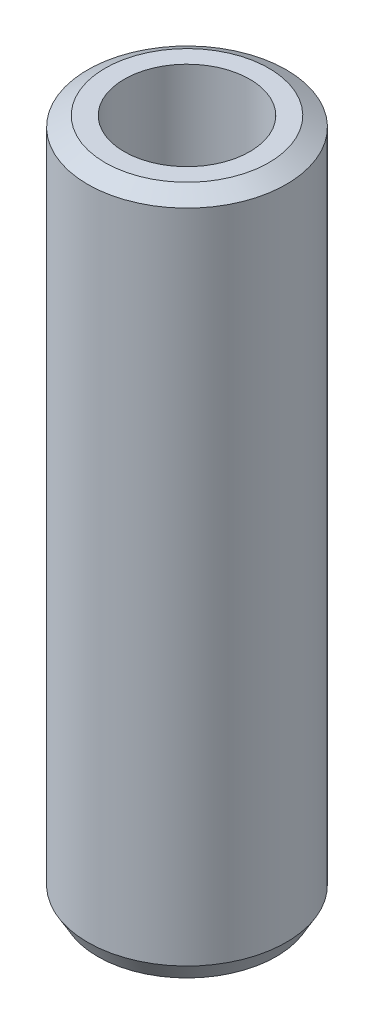
ISO-10303-21;
HEADER;
FILE_DESCRIPTION(('STEP AP214'),'2;1');
FILE_NAME('part.step','',(''),(''),'','','');
FILE_SCHEMA(('AUTOMOTIVE_DESIGN { 1 0 10303 214 1 1 1 1 }'));
ENDSEC;
DATA;
#1=APPLICATION_CONTEXT('core data for automotive mechanical design processes');
#2=APPLICATION_PROTOCOL_DEFINITION('international standard','automotive_design',2000,#1);
#3=PRODUCT_CONTEXT('',#1,'mechanical');
#4=PRODUCT('Part','Part','',(#3));
#5=PRODUCT_RELATED_PRODUCT_CATEGORY('part','',(#4));
#6=PRODUCT_DEFINITION_FORMATION('','',#4);
#7=PRODUCT_DEFINITION_CONTEXT('part definition',#1,'design');
#8=PRODUCT_DEFINITION('design','',#6,#7);
#9=PRODUCT_DEFINITION_SHAPE('','',#8);
#10=(LENGTH_UNIT() NAMED_UNIT(*) SI_UNIT(.MILLI.,.METRE.));
#11=(NAMED_UNIT(*) PLANE_ANGLE_UNIT() SI_UNIT($,.RADIAN.));
#12=(NAMED_UNIT(*) SI_UNIT($,.STERADIAN.) SOLID_ANGLE_UNIT());
#13=UNCERTAINTY_MEASURE_WITH_UNIT(LENGTH_MEASURE(1.E-05),#10,'distance_accuracy_value','');
#14=(GEOMETRIC_REPRESENTATION_CONTEXT(3) GLOBAL_UNCERTAINTY_ASSIGNED_CONTEXT((#13)) GLOBAL_UNIT_ASSIGNED_CONTEXT((#10,
#11,#12)) REPRESENTATION_CONTEXT('',''));
#15=CARTESIAN_POINT('',(0.,0.,0.));
#16=DIRECTION('',(0.,0.,1.));
#17=DIRECTION('',(1.,0.,0.));
#18=AXIS2_PLACEMENT_3D('',#15,#16,#17);
#19=CARTESIAN_POINT('',(0.,292.654685316283,0.));
#20=DIRECTION('',(0.,-1.,0.));
#21=DIRECTION('',(0.,0.,-1.));
#22=AXIS2_PLACEMENT_3D('',#19,#20,#21);
#23=CYLINDRICAL_SURFACE('',#22,42.5);
#24=CARTESIAN_POINT('',(0.,288.345384251531,0.));
#25=DIRECTION('',(0.,1.,0.));
#26=DIRECTION('',(0.,0.,1.));
#27=AXIS2_PLACEMENT_3D('',#24,#25,#26);
#28=CIRCLE('',#27,42.5);
#29=CARTESIAN_POINT('',(0.,288.345384251531,42.5));
#30=VERTEX_POINT('',#29);
#31=EDGE_CURVE('E50',#30,#30,#28,.F.);
#32=ORIENTED_EDGE('',*,*,#31,.T.);
#33=EDGE_LOOP('',(#32));
#34=FACE_BOUND('',#33,.T.);
#35=CARTESIAN_POINT('',(0.,7.46392838926091,0.));
#36=DIRECTION('',(0.,1.,0.));
#37=DIRECTION('',(0.,0.,1.));
#38=AXIS2_PLACEMENT_3D('',#35,#36,#37);
#39=CIRCLE('',#38,42.5);
#40=CARTESIAN_POINT('',(0.,7.46392838926091,42.5));
#41=VERTEX_POINT('',#40);
#42=EDGE_CURVE('E51',#41,#41,#39,.T.);
#43=ORIENTED_EDGE('',*,*,#42,.T.);
#44=EDGE_LOOP('',(#43));
#45=FACE_BOUND('',#44,.T.);
#46=ADVANCED_FACE('F39',(#34,#45),#23,.T.);
#47=CARTESIAN_POINT('',(0.,292.654685316283,0.));
#48=DIRECTION('',(0.,1.,0.));
#49=DIRECTION('',(0.,0.,1.));
#50=AXIS2_PLACEMENT_3D('',#47,#48,#49);
#51=PLANE('',#50);
#52=CARTESIAN_POINT('',(0.,292.654685316283,0.));
#53=DIRECTION('',(0.,1.,0.));
#54=DIRECTION('',(0.,0.,1.));
#55=AXIS2_PLACEMENT_3D('',#52,#53,#54);
#56=CIRCLE('',#55,35.0360716107389);
#57=CARTESIAN_POINT('',(0.,292.654685316283,35.0360716107389));
#58=VERTEX_POINT('',#57);
#59=EDGE_CURVE('E54',#58,#58,#56,.T.);
#60=ORIENTED_EDGE('',*,*,#59,.T.);
#61=EDGE_LOOP('',(#60));
#62=FACE_BOUND('',#61,.T.);
#63=CARTESIAN_POINT('',(0.,292.654685316283,0.));
#64=DIRECTION('',(0.,1.,0.));
#65=DIRECTION('',(0.,0.,1.));
#66=AXIS2_PLACEMENT_3D('',#63,#64,#65);
#67=CIRCLE('',#66,26.87195569212);
#68=CARTESIAN_POINT('',(0.,292.654685316283,26.87195569212));
#69=VERTEX_POINT('',#68);
#70=EDGE_CURVE('E58',#69,#69,#67,.T.);
#71=ORIENTED_EDGE('',*,*,#70,.F.);
#72=EDGE_LOOP('',(#71));
#73=FACE_BOUND('',#72,.T.);
#74=ADVANCED_FACE('F69',(#62,#73),#51,.T.);
#75=CARTESIAN_POINT('',(0.,0.,0.));
#76=DIRECTION('',(0.,1.,0.));
#77=DIRECTION('',(0.,0.,1.));
#78=AXIS2_PLACEMENT_3D('',#75,#76,#77);
#79=PLANE('',#78);
#80=CARTESIAN_POINT('',(0.,0.,0.));
#81=DIRECTION('',(0.,1.,0.));
#82=DIRECTION('',(0.,0.,1.));
#83=AXIS2_PLACEMENT_3D('',#80,#81,#82);
#84=CIRCLE('',#83,38.1906989352481);
#85=CARTESIAN_POINT('',(0.,0.,38.1906989352481));
#86=VERTEX_POINT('',#85);
#87=EDGE_CURVE('E10',#86,#86,#84,.F.);
#88=ORIENTED_EDGE('',*,*,#87,.T.);
#89=EDGE_LOOP('',(#88));
#90=FACE_BOUND('',#89,.T.);
#91=CARTESIAN_POINT('',(0.,0.,0.));
#92=DIRECTION('',(0.,1.,0.));
#93=DIRECTION('',(0.,0.,1.));
#94=AXIS2_PLACEMENT_3D('',#91,#92,#93);
#95=CIRCLE('',#94,26.87195569212);
#96=CARTESIAN_POINT('',(0.,0.,26.87195569212));
#97=VERTEX_POINT('',#96);
#98=EDGE_CURVE('E63',#97,#97,#95,.T.);
#99=ORIENTED_EDGE('',*,*,#98,.T.);
#100=EDGE_LOOP('',(#99));
#101=FACE_BOUND('',#100,.T.);
#102=ADVANCED_FACE('F75',(#90,#101),#79,.F.);
#103=CARTESIAN_POINT('',(0.,292.654685316283,0.));
#104=DIRECTION('',(0.,-1.,0.));
#105=DIRECTION('',(0.,0.,-1.));
#106=AXIS2_PLACEMENT_3D('',#103,#104,#105);
#107=CYLINDRICAL_SURFACE('',#106,26.87195569212);
#108=ORIENTED_EDGE('',*,*,#70,.T.);
#109=EDGE_LOOP('',(#108));
#110=FACE_BOUND('',#109,.T.);
#111=ORIENTED_EDGE('',*,*,#98,.F.);
#112=EDGE_LOOP('',(#111));
#113=FACE_BOUND('',#112,.T.);
#114=ADVANCED_FACE('F70',(#110,#113),#107,.F.);
#115=CARTESIAN_POINT('',(0.,292.654685316283,0.));
#116=DIRECTION('',(0.,-1.,0.));
#117=DIRECTION('',(0.,0.,-1.));
#118=AXIS2_PLACEMENT_3D('',#115,#116,#117);
#119=CONICAL_SURFACE('',#118,35.0360716107389,1.04719755119659);
#120=ORIENTED_EDGE('',*,*,#31,.F.);
#121=EDGE_LOOP('',(#120));
#122=FACE_BOUND('',#121,.T.);
#123=ORIENTED_EDGE('',*,*,#59,.F.);
#124=EDGE_LOOP('',(#123));
#125=FACE_BOUND('',#124,.T.);
#126=ADVANCED_FACE('F81',(#122,#125),#119,.T.);
#127=CARTESIAN_POINT('',(0.,7.46392838926091,0.));
#128=DIRECTION('',(0.,1.,0.));
#129=DIRECTION('',(0.,0.,1.));
#130=AXIS2_PLACEMENT_3D('',#127,#128,#129);
#131=CONICAL_SURFACE('',#130,42.5,0.523598775598305);
#132=ORIENTED_EDGE('',*,*,#87,.F.);
#133=EDGE_LOOP('',(#132));
#134=FACE_BOUND('',#133,.T.);
#135=ORIENTED_EDGE('',*,*,#42,.F.);
#136=EDGE_LOOP('',(#135));
#137=FACE_BOUND('',#136,.T.);
#138=ADVANCED_FACE('F45',(#134,#137),#131,.T.);
#139=CLOSED_SHELL('',(#46,#74,#102,#114,#126,#138));
#140=MANIFOLD_SOLID_BREP('B2',#139);
#141=ADVANCED_BREP_SHAPE_REPRESENTATION('',(#18,#140),#14);
#142=SHAPE_DEFINITION_REPRESENTATION(#9,#141);
ENDSEC;
END-ISO-10303-21;
